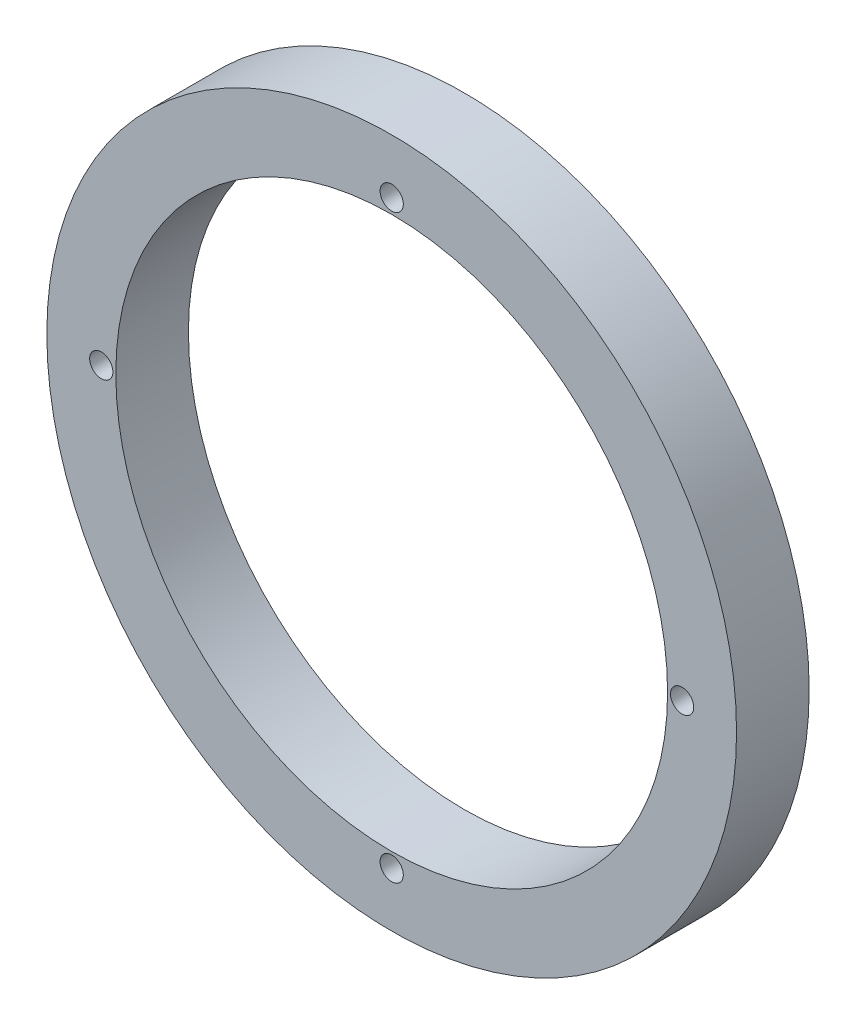
ISO-10303-21;
HEADER;
FILE_DESCRIPTION(('STEP AP214'),'2;1');
FILE_NAME('part.step','',(''),(''),'','','');
FILE_SCHEMA(('AUTOMOTIVE_DESIGN { 1 0 10303 214 1 1 1 1 }'));
ENDSEC;
DATA;
#1=APPLICATION_CONTEXT('core data for automotive mechanical design processes');
#2=APPLICATION_PROTOCOL_DEFINITION('international standard','automotive_design',2000,#1);
#3=PRODUCT_CONTEXT('',#1,'mechanical');
#4=PRODUCT('Part','Part','',(#3));
#5=PRODUCT_RELATED_PRODUCT_CATEGORY('part','',(#4));
#6=PRODUCT_DEFINITION_FORMATION('','',#4);
#7=PRODUCT_DEFINITION_CONTEXT('part definition',#1,'design');
#8=PRODUCT_DEFINITION('design','',#6,#7);
#9=PRODUCT_DEFINITION_SHAPE('','',#8);
#10=(LENGTH_UNIT() NAMED_UNIT(*) SI_UNIT(.MILLI.,.METRE.));
#11=(NAMED_UNIT(*) PLANE_ANGLE_UNIT() SI_UNIT($,.RADIAN.));
#12=(NAMED_UNIT(*) SI_UNIT($,.STERADIAN.) SOLID_ANGLE_UNIT());
#13=UNCERTAINTY_MEASURE_WITH_UNIT(LENGTH_MEASURE(1.E-05),#10,'distance_accuracy_value','');
#14=(GEOMETRIC_REPRESENTATION_CONTEXT(3) GLOBAL_UNCERTAINTY_ASSIGNED_CONTEXT((#13)) GLOBAL_UNIT_ASSIGNED_CONTEXT((#10,
#11,#12)) REPRESENTATION_CONTEXT('',''));
#15=CARTESIAN_POINT('',(0.,0.,0.));
#16=DIRECTION('',(0.,0.,1.));
#17=DIRECTION('',(1.,0.,0.));
#18=AXIS2_PLACEMENT_3D('',#15,#16,#17);
#19=CARTESIAN_POINT('',(0.,0.,1.));
#20=DIRECTION('',(0.,0.,-1.));
#21=DIRECTION('',(-1.,0.,0.));
#22=AXIS2_PLACEMENT_3D('',#19,#20,#21);
#23=CYLINDRICAL_SURFACE('',#22,3.8);
#24=CARTESIAN_POINT('',(0.,0.,1.));
#25=DIRECTION('',(0.,0.,1.));
#26=DIRECTION('',(1.,0.,0.));
#27=AXIS2_PLACEMENT_3D('',#24,#25,#26);
#28=CIRCLE('',#27,3.8);
#29=CARTESIAN_POINT('',(3.8,0.,1.));
#30=VERTEX_POINT('',#29);
#31=EDGE_CURVE('E40',#30,#30,#28,.T.);
#32=ORIENTED_EDGE('',*,*,#31,.T.);
#33=EDGE_LOOP('',(#32));
#34=FACE_BOUND('',#33,.T.);
#35=CARTESIAN_POINT('',(0.,0.,0.));
#36=DIRECTION('',(0.,0.,1.));
#37=DIRECTION('',(1.,0.,0.));
#38=AXIS2_PLACEMENT_3D('',#35,#36,#37);
#39=CIRCLE('',#38,3.8);
#40=CARTESIAN_POINT('',(3.8,0.,0.));
#41=VERTEX_POINT('',#40);
#42=EDGE_CURVE('E60',#41,#41,#39,.T.);
#43=ORIENTED_EDGE('',*,*,#42,.F.);
#44=EDGE_LOOP('',(#43));
#45=FACE_BOUND('',#44,.T.);
#46=ADVANCED_FACE('F32',(#34,#45),#23,.F.);
#47=CARTESIAN_POINT('',(4.00000000000011,1.13196979001957E-13,1.));
#48=DIRECTION('',(0.,0.,-1.));
#49=DIRECTION('',(-1.,0.,0.));
#50=AXIS2_PLACEMENT_3D('',#47,#48,#49);
#51=CYLINDRICAL_SURFACE('',#50,0.160000000000088);
#52=CARTESIAN_POINT('',(4.00000000000011,1.13196979001957E-13,1.));
#53=DIRECTION('',(0.,0.,1.));
#54=DIRECTION('',(1.,0.,0.));
#55=AXIS2_PLACEMENT_3D('',#52,#53,#54);
#56=CIRCLE('',#55,0.160000000000088);
#57=CARTESIAN_POINT('',(4.1600000000002,1.13196979001957E-13,1.));
#58=VERTEX_POINT('',#57);
#59=EDGE_CURVE('E45',#58,#58,#56,.T.);
#60=ORIENTED_EDGE('',*,*,#59,.T.);
#61=EDGE_LOOP('',(#60));
#62=FACE_BOUND('',#61,.T.);
#63=CARTESIAN_POINT('',(4.00000000000011,1.13196979001957E-13,0.));
#64=DIRECTION('',(0.,0.,1.));
#65=DIRECTION('',(1.,0.,0.));
#66=AXIS2_PLACEMENT_3D('',#63,#64,#65);
#67=CIRCLE('',#66,0.160000000000088);
#68=CARTESIAN_POINT('',(4.1600000000002,1.13196979001957E-13,0.));
#69=VERTEX_POINT('',#68);
#70=EDGE_CURVE('E58',#69,#69,#67,.T.);
#71=ORIENTED_EDGE('',*,*,#70,.F.);
#72=EDGE_LOOP('',(#71));
#73=FACE_BOUND('',#72,.T.);
#74=ADVANCED_FACE('F81',(#62,#73),#51,.F.);
#75=CARTESIAN_POINT('',(2.26393958003914E-13,-4.,1.));
#76=DIRECTION('',(0.,0.,-1.));
#77=DIRECTION('',(-1.,0.,0.));
#78=AXIS2_PLACEMENT_3D('',#75,#76,#77);
#79=CYLINDRICAL_SURFACE('',#78,0.160000000000243);
#80=CARTESIAN_POINT('',(2.26393958003914E-13,-4.,1.));
#81=DIRECTION('',(0.,0.,1.));
#82=DIRECTION('',(1.,0.,0.));
#83=AXIS2_PLACEMENT_3D('',#80,#81,#82);
#84=CIRCLE('',#83,0.160000000000243);
#85=CARTESIAN_POINT('',(0.16000000000047,-4.,1.));
#86=VERTEX_POINT('',#85);
#87=EDGE_CURVE('E74',#86,#86,#84,.T.);
#88=ORIENTED_EDGE('',*,*,#87,.T.);
#89=EDGE_LOOP('',(#88));
#90=FACE_BOUND('',#89,.T.);
#91=CARTESIAN_POINT('',(2.26393958003914E-13,-4.,0.));
#92=DIRECTION('',(0.,0.,1.));
#93=DIRECTION('',(1.,0.,0.));
#94=AXIS2_PLACEMENT_3D('',#91,#92,#93);
#95=CIRCLE('',#94,0.160000000000243);
#96=CARTESIAN_POINT('',(0.16000000000047,-4.,0.));
#97=VERTEX_POINT('',#96);
#98=EDGE_CURVE('E55',#97,#97,#95,.T.);
#99=ORIENTED_EDGE('',*,*,#98,.F.);
#100=EDGE_LOOP('',(#99));
#101=FACE_BOUND('',#100,.T.);
#102=ADVANCED_FACE('F99',(#90,#101),#79,.F.);
#103=CARTESIAN_POINT('',(-3.99999999999989,-1.13686837721616E-13,1.));
#104=DIRECTION('',(0.,0.,-1.));
#105=DIRECTION('',(-1.,0.,0.));
#106=AXIS2_PLACEMENT_3D('',#103,#104,#105);
#107=CYLINDRICAL_SURFACE('',#106,0.160000000000181);
#108=CARTESIAN_POINT('',(-3.99999999999989,-1.13686837721616E-13,1.));
#109=DIRECTION('',(0.,0.,1.));
#110=DIRECTION('',(1.,0.,0.));
#111=AXIS2_PLACEMENT_3D('',#108,#109,#110);
#112=CIRCLE('',#111,0.160000000000181);
#113=CARTESIAN_POINT('',(-3.83999999999971,-1.13686837721616E-13,1.));
#114=VERTEX_POINT('',#113);
#115=EDGE_CURVE('E69',#114,#114,#112,.T.);
#116=ORIENTED_EDGE('',*,*,#115,.T.);
#117=EDGE_LOOP('',(#116));
#118=FACE_BOUND('',#117,.T.);
#119=CARTESIAN_POINT('',(-3.99999999999989,-1.13686837721616E-13,0.));
#120=DIRECTION('',(0.,0.,1.));
#121=DIRECTION('',(1.,0.,0.));
#122=AXIS2_PLACEMENT_3D('',#119,#120,#121);
#123=CIRCLE('',#122,0.160000000000181);
#124=CARTESIAN_POINT('',(-3.83999999999971,-1.13686837721616E-13,0.));
#125=VERTEX_POINT('',#124);
#126=EDGE_CURVE('E52',#125,#125,#123,.T.);
#127=ORIENTED_EDGE('',*,*,#126,.F.);
#128=EDGE_LOOP('',(#127));
#129=FACE_BOUND('',#128,.T.);
#130=ADVANCED_FACE('F105',(#118,#129),#107,.F.);
#131=CARTESIAN_POINT('',(0.,4.,1.));
#132=DIRECTION('',(0.,0.,-1.));
#133=DIRECTION('',(-1.,0.,0.));
#134=AXIS2_PLACEMENT_3D('',#131,#132,#133);
#135=CYLINDRICAL_SURFACE('',#134,0.16);
#136=CARTESIAN_POINT('',(0.,4.,1.));
#137=DIRECTION('',(0.,0.,1.));
#138=DIRECTION('',(1.,0.,0.));
#139=AXIS2_PLACEMENT_3D('',#136,#137,#138);
#140=CIRCLE('',#139,0.16);
#141=CARTESIAN_POINT('',(0.16,4.,1.));
#142=VERTEX_POINT('',#141);
#143=EDGE_CURVE('E65',#142,#142,#140,.T.);
#144=ORIENTED_EDGE('',*,*,#143,.T.);
#145=EDGE_LOOP('',(#144));
#146=FACE_BOUND('',#145,.T.);
#147=CARTESIAN_POINT('',(0.,4.,0.));
#148=DIRECTION('',(0.,0.,1.));
#149=DIRECTION('',(1.,0.,0.));
#150=AXIS2_PLACEMENT_3D('',#147,#148,#149);
#151=CIRCLE('',#150,0.16);
#152=CARTESIAN_POINT('',(0.16,4.,0.));
#153=VERTEX_POINT('',#152);
#154=EDGE_CURVE('E49',#153,#153,#151,.T.);
#155=ORIENTED_EDGE('',*,*,#154,.F.);
#156=EDGE_LOOP('',(#155));
#157=FACE_BOUND('',#156,.T.);
#158=ADVANCED_FACE('F34',(#146,#157),#135,.F.);
#159=CARTESIAN_POINT('',(0.,0.,1.));
#160=DIRECTION('',(0.,0.,-1.));
#161=DIRECTION('',(-1.,0.,0.));
#162=AXIS2_PLACEMENT_3D('',#159,#160,#161);
#163=CYLINDRICAL_SURFACE('',#162,4.75);
#164=CARTESIAN_POINT('',(0.,0.,1.));
#165=DIRECTION('',(0.,0.,1.));
#166=DIRECTION('',(1.,0.,0.));
#167=AXIS2_PLACEMENT_3D('',#164,#165,#166);
#168=CIRCLE('',#167,4.75);
#169=CARTESIAN_POINT('',(4.75,0.,1.));
#170=VERTEX_POINT('',#169);
#171=EDGE_CURVE('E10',#170,#170,#168,.T.);
#172=ORIENTED_EDGE('',*,*,#171,.F.);
#173=EDGE_LOOP('',(#172));
#174=FACE_BOUND('',#173,.T.);
#175=CARTESIAN_POINT('',(0.,0.,0.));
#176=DIRECTION('',(0.,0.,1.));
#177=DIRECTION('',(1.,0.,0.));
#178=AXIS2_PLACEMENT_3D('',#175,#176,#177);
#179=CIRCLE('',#178,4.75);
#180=CARTESIAN_POINT('',(4.75,0.,0.));
#181=VERTEX_POINT('',#180);
#182=EDGE_CURVE('E36',#181,#181,#179,.T.);
#183=ORIENTED_EDGE('',*,*,#182,.T.);
#184=EDGE_LOOP('',(#183));
#185=FACE_BOUND('',#184,.T.);
#186=ADVANCED_FACE('F88',(#174,#185),#163,.T.);
#187=CARTESIAN_POINT('',(0.,0.,1.));
#188=DIRECTION('',(0.,0.,1.));
#189=DIRECTION('',(1.,0.,0.));
#190=AXIS2_PLACEMENT_3D('',#187,#188,#189);
#191=PLANE('',#190);
#192=ORIENTED_EDGE('',*,*,#143,.F.);
#193=EDGE_LOOP('',(#192));
#194=FACE_BOUND('',#193,.T.);
#195=ORIENTED_EDGE('',*,*,#115,.F.);
#196=EDGE_LOOP('',(#195));
#197=FACE_BOUND('',#196,.T.);
#198=ORIENTED_EDGE('',*,*,#87,.F.);
#199=EDGE_LOOP('',(#198));
#200=FACE_BOUND('',#199,.T.);
#201=ORIENTED_EDGE('',*,*,#59,.F.);
#202=EDGE_LOOP('',(#201));
#203=FACE_BOUND('',#202,.T.);
#204=ORIENTED_EDGE('',*,*,#31,.F.);
#205=EDGE_LOOP('',(#204));
#206=FACE_BOUND('',#205,.T.);
#207=ORIENTED_EDGE('',*,*,#171,.T.);
#208=EDGE_LOOP('',(#207));
#209=FACE_BOUND('',#208,.T.);
#210=ADVANCED_FACE('F84',(#194,#197,#200,#203,#206,#209),#191,.T.);
#211=CARTESIAN_POINT('',(0.,0.,0.));
#212=DIRECTION('',(0.,0.,1.));
#213=DIRECTION('',(1.,0.,0.));
#214=AXIS2_PLACEMENT_3D('',#211,#212,#213);
#215=PLANE('',#214);
#216=ORIENTED_EDGE('',*,*,#154,.T.);
#217=EDGE_LOOP('',(#216));
#218=FACE_BOUND('',#217,.T.);
#219=ORIENTED_EDGE('',*,*,#126,.T.);
#220=EDGE_LOOP('',(#219));
#221=FACE_BOUND('',#220,.T.);
#222=ORIENTED_EDGE('',*,*,#98,.T.);
#223=EDGE_LOOP('',(#222));
#224=FACE_BOUND('',#223,.T.);
#225=ORIENTED_EDGE('',*,*,#70,.T.);
#226=EDGE_LOOP('',(#225));
#227=FACE_BOUND('',#226,.T.);
#228=ORIENTED_EDGE('',*,*,#42,.T.);
#229=EDGE_LOOP('',(#228));
#230=FACE_BOUND('',#229,.T.);
#231=ORIENTED_EDGE('',*,*,#182,.F.);
#232=EDGE_LOOP('',(#231));
#233=FACE_BOUND('',#232,.T.);
#234=ADVANCED_FACE('F87',(#218,#221,#224,#227,#230,#233),#215,.F.);
#235=CLOSED_SHELL('',(#46,#74,#102,#130,#158,#186,#210,#234));
#236=MANIFOLD_SOLID_BREP('B2',#235);
#237=ADVANCED_BREP_SHAPE_REPRESENTATION('',(#18,#236),#14);
#238=SHAPE_DEFINITION_REPRESENTATION(#9,#237);
ENDSEC;
END-ISO-10303-21;
